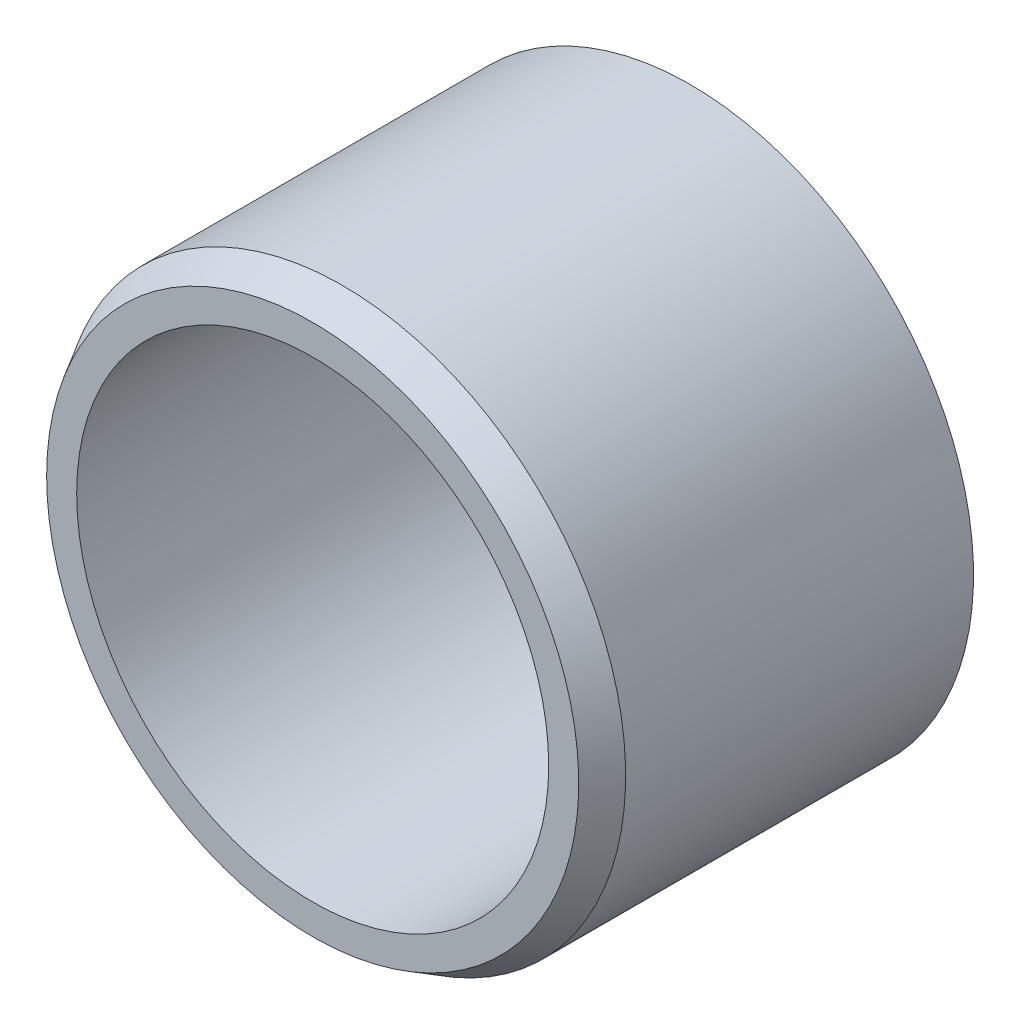
ISO-10303-21;
HEADER;
FILE_DESCRIPTION(('STEP AP214'),'2;1');
FILE_NAME('part.step','',(''),(''),'','','');
FILE_SCHEMA(('AUTOMOTIVE_DESIGN { 1 0 10303 214 1 1 1 1 }'));
ENDSEC;
DATA;
#1=APPLICATION_CONTEXT('core data for automotive mechanical design processes');
#2=APPLICATION_PROTOCOL_DEFINITION('international standard','automotive_design',2000,#1);
#3=PRODUCT_CONTEXT('',#1,'mechanical');
#4=PRODUCT('Part','Part','',(#3));
#5=PRODUCT_RELATED_PRODUCT_CATEGORY('part','',(#4));
#6=PRODUCT_DEFINITION_FORMATION('','',#4);
#7=PRODUCT_DEFINITION_CONTEXT('part definition',#1,'design');
#8=PRODUCT_DEFINITION('design','',#6,#7);
#9=PRODUCT_DEFINITION_SHAPE('','',#8);
#10=(LENGTH_UNIT() NAMED_UNIT(*) SI_UNIT(.MILLI.,.METRE.));
#11=(NAMED_UNIT(*) PLANE_ANGLE_UNIT() SI_UNIT($,.RADIAN.));
#12=(NAMED_UNIT(*) SI_UNIT($,.STERADIAN.) SOLID_ANGLE_UNIT());
#13=UNCERTAINTY_MEASURE_WITH_UNIT(LENGTH_MEASURE(1.E-05),#10,'distance_accuracy_value','');
#14=(GEOMETRIC_REPRESENTATION_CONTEXT(3) GLOBAL_UNCERTAINTY_ASSIGNED_CONTEXT((#13)) GLOBAL_UNIT_ASSIGNED_CONTEXT((#10,
#11,#12)) REPRESENTATION_CONTEXT('',''));
#15=CARTESIAN_POINT('',(0.,0.,0.));
#16=DIRECTION('',(0.,0.,1.));
#17=DIRECTION('',(1.,0.,0.));
#18=AXIS2_PLACEMENT_3D('',#15,#16,#17);
#19=CARTESIAN_POINT('',(0.,0.,5.85000000003598));
#20=DIRECTION('',(0.,0.,-1.));
#21=DIRECTION('',(-1.,0.,0.));
#22=AXIS2_PLACEMENT_3D('',#19,#20,#21);
#23=CONICAL_SURFACE('',#22,4.76249999999008,0.523598775598298);
#24=CARTESIAN_POINT('',(0.,0.,6.35));
#25=DIRECTION('',(0.,0.,-1.));
#26=DIRECTION('',(-1.,0.,0.));
#27=AXIS2_PLACEMENT_3D('',#24,#25,#26);
#28=CIRCLE('',#27,4.47382486541604);
#29=CARTESIAN_POINT('',(-4.47382486541604,0.,6.35));
#30=VERTEX_POINT('',#29);
#31=EDGE_CURVE('E10',#30,#30,#28,.T.);
#32=ORIENTED_EDGE('',*,*,#31,.T.);
#33=EDGE_LOOP('',(#32));
#34=FACE_BOUND('',#33,.T.);
#35=CARTESIAN_POINT('',(0.,0.,5.85000000003598));
#36=DIRECTION('',(0.,0.,-1.));
#37=DIRECTION('',(-1.,0.,0.));
#38=AXIS2_PLACEMENT_3D('',#35,#36,#37);
#39=CIRCLE('',#38,4.76249999999008);
#40=CARTESIAN_POINT('',(-4.76249999999008,0.,5.85000000003598));
#41=VERTEX_POINT('',#40);
#42=EDGE_CURVE('E53',#41,#41,#39,.T.);
#43=ORIENTED_EDGE('',*,*,#42,.F.);
#44=EDGE_LOOP('',(#43));
#45=FACE_BOUND('',#44,.T.);
#46=ADVANCED_FACE('F31',(#34,#45),#23,.T.);
#47=CARTESIAN_POINT('',(4.47382486541604,0.,6.35));
#48=DIRECTION('',(0.,0.,1.));
#49=DIRECTION('',(1.,0.,0.));
#50=AXIS2_PLACEMENT_3D('',#47,#48,#49);
#51=PLANE('',#50);
#52=CARTESIAN_POINT('',(0.,0.,6.35));
#53=DIRECTION('',(0.,0.,-1.));
#54=DIRECTION('',(-1.,0.,0.));
#55=AXIS2_PLACEMENT_3D('',#52,#53,#54);
#56=CIRCLE('',#55,3.96875000003032);
#57=CARTESIAN_POINT('',(-3.96875000003032,0.,6.35));
#58=VERTEX_POINT('',#57);
#59=EDGE_CURVE('E37',#58,#58,#56,.T.);
#60=ORIENTED_EDGE('',*,*,#59,.T.);
#61=EDGE_LOOP('',(#60));
#62=FACE_BOUND('',#61,.T.);
#63=ORIENTED_EDGE('',*,*,#31,.F.);
#64=EDGE_LOOP('',(#63));
#65=FACE_BOUND('',#64,.T.);
#66=ADVANCED_FACE('F61',(#62,#65),#51,.T.);
#67=CARTESIAN_POINT('',(0.,0.,6.35));
#68=DIRECTION('',(0.,0.,-1.));
#69=DIRECTION('',(-1.,0.,0.));
#70=AXIS2_PLACEMENT_3D('',#67,#68,#69);
#71=CYLINDRICAL_SURFACE('',#70,3.96875000003032);
#72=CARTESIAN_POINT('',(0.,0.,0.499999999988176));
#73=DIRECTION('',(0.,0.,-1.));
#74=DIRECTION('',(-1.,0.,0.));
#75=AXIS2_PLACEMENT_3D('',#72,#73,#74);
#76=CIRCLE('',#75,3.96875000003032);
#77=CARTESIAN_POINT('',(-3.96875000003032,0.,0.499999999988176));
#78=VERTEX_POINT('',#77);
#79=EDGE_CURVE('E41',#78,#78,#76,.T.);
#80=ORIENTED_EDGE('',*,*,#79,.T.);
#81=EDGE_LOOP('',(#80));
#82=FACE_BOUND('',#81,.T.);
#83=ORIENTED_EDGE('',*,*,#59,.F.);
#84=EDGE_LOOP('',(#83));
#85=FACE_BOUND('',#84,.T.);
#86=ADVANCED_FACE('F65',(#82,#85),#71,.F.);
#87=CARTESIAN_POINT('',(0.,0.,0.499999999988176));
#88=DIRECTION('',(0.,0.,-1.));
#89=DIRECTION('',(-1.,0.,0.));
#90=AXIS2_PLACEMENT_3D('',#87,#88,#89);
#91=CONICAL_SURFACE('',#90,3.96875000003032,0.523598775598299);
#92=CARTESIAN_POINT('',(0.,0.,1.6904880273394E-12));
#93=DIRECTION('',(0.,0.,-1.));
#94=DIRECTION('',(-1.,0.,0.));
#95=AXIS2_PLACEMENT_3D('',#92,#93,#94);
#96=CIRCLE('',#95,4.25742513461733);
#97=CARTESIAN_POINT('',(-4.25742513461733,0.,1.6904880273394E-12));
#98=VERTEX_POINT('',#97);
#99=EDGE_CURVE('E45',#98,#98,#96,.T.);
#100=ORIENTED_EDGE('',*,*,#99,.T.);
#101=EDGE_LOOP('',(#100));
#102=FACE_BOUND('',#101,.T.);
#103=ORIENTED_EDGE('',*,*,#79,.F.);
#104=EDGE_LOOP('',(#103));
#105=FACE_BOUND('',#104,.T.);
#106=ADVANCED_FACE('F69',(#102,#105),#91,.F.);
#107=CARTESIAN_POINT('',(4.25742513461733,0.,1.6904880273394E-12));
#108=DIRECTION('',(0.,0.,-1.));
#109=DIRECTION('',(-1.,0.,0.));
#110=AXIS2_PLACEMENT_3D('',#107,#108,#109);
#111=PLANE('',#110);
#112=CARTESIAN_POINT('',(0.,0.,1.6904880273394E-12));
#113=DIRECTION('',(0.,0.,-1.));
#114=DIRECTION('',(-1.,0.,0.));
#115=AXIS2_PLACEMENT_3D('',#112,#113,#114);
#116=CIRCLE('',#115,4.76249999999008);
#117=CARTESIAN_POINT('',(-4.76249999999008,0.,1.6904880273394E-12));
#118=VERTEX_POINT('',#117);
#119=EDGE_CURVE('E50',#118,#118,#116,.T.);
#120=ORIENTED_EDGE('',*,*,#119,.T.);
#121=EDGE_LOOP('',(#120));
#122=FACE_BOUND('',#121,.T.);
#123=ORIENTED_EDGE('',*,*,#99,.F.);
#124=EDGE_LOOP('',(#123));
#125=FACE_BOUND('',#124,.T.);
#126=ADVANCED_FACE('F76',(#122,#125),#111,.T.);
#127=CARTESIAN_POINT('',(0.,0.,6.35));
#128=DIRECTION('',(0.,0.,-1.));
#129=DIRECTION('',(-1.,0.,0.));
#130=AXIS2_PLACEMENT_3D('',#127,#128,#129);
#131=CYLINDRICAL_SURFACE('',#130,4.76249999999008);
#132=ORIENTED_EDGE('',*,*,#42,.T.);
#133=EDGE_LOOP('',(#132));
#134=FACE_BOUND('',#133,.T.);
#135=ORIENTED_EDGE('',*,*,#119,.F.);
#136=EDGE_LOOP('',(#135));
#137=FACE_BOUND('',#136,.T.);
#138=ADVANCED_FACE('F57',(#134,#137),#131,.T.);
#139=CLOSED_SHELL('',(#46,#66,#86,#106,#126,#138));
#140=MANIFOLD_SOLID_BREP('B2',#139);
#141=ADVANCED_BREP_SHAPE_REPRESENTATION('',(#18,#140),#14);
#142=SHAPE_DEFINITION_REPRESENTATION(#9,#141);
ENDSEC;
END-ISO-10303-21;
